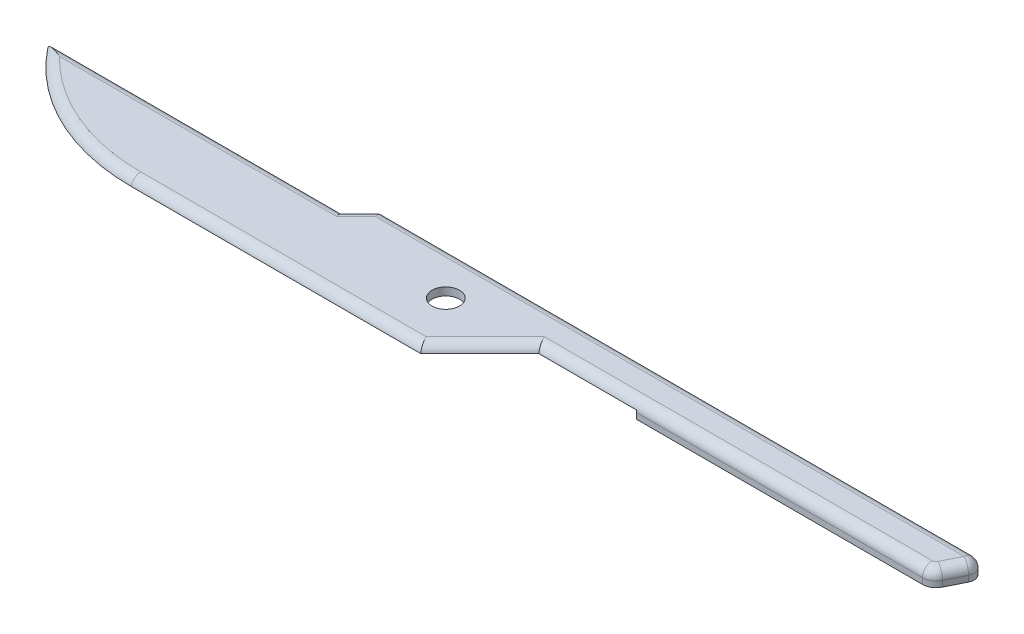
ISO-10303-21;
HEADER;
FILE_DESCRIPTION(('STEP AP214'),'2;1');
FILE_NAME('part.step','',(''),(''),'','','');
FILE_SCHEMA(('AUTOMOTIVE_DESIGN { 1 0 10303 214 1 1 1 1 }'));
ENDSEC;
DATA;
#1=APPLICATION_CONTEXT('core data for automotive mechanical design processes');
#2=APPLICATION_PROTOCOL_DEFINITION('international standard','automotive_design',2000,#1);
#3=PRODUCT_CONTEXT('',#1,'mechanical');
#4=PRODUCT('Part','Part','',(#3));
#5=PRODUCT_RELATED_PRODUCT_CATEGORY('part','',(#4));
#6=PRODUCT_DEFINITION_FORMATION('','',#4);
#7=PRODUCT_DEFINITION_CONTEXT('part definition',#1,'design');
#8=PRODUCT_DEFINITION('design','',#6,#7);
#9=PRODUCT_DEFINITION_SHAPE('','',#8);
#10=(LENGTH_UNIT() NAMED_UNIT(*) SI_UNIT(.MILLI.,.METRE.));
#11=(NAMED_UNIT(*) PLANE_ANGLE_UNIT() SI_UNIT($,.RADIAN.));
#12=(NAMED_UNIT(*) SI_UNIT($,.STERADIAN.) SOLID_ANGLE_UNIT());
#13=UNCERTAINTY_MEASURE_WITH_UNIT(LENGTH_MEASURE(1.E-05),#10,'distance_accuracy_value','');
#14=(GEOMETRIC_REPRESENTATION_CONTEXT(3) GLOBAL_UNCERTAINTY_ASSIGNED_CONTEXT((#13)) GLOBAL_UNIT_ASSIGNED_CONTEXT((#10,
#11,#12)) REPRESENTATION_CONTEXT('',''));
#15=CARTESIAN_POINT('',(0.,0.,0.));
#16=DIRECTION('',(0.,0.,1.));
#17=DIRECTION('',(1.,0.,0.));
#18=AXIS2_PLACEMENT_3D('',#15,#16,#17);
#19=CARTESIAN_POINT('',(10.4726882890689,1.016,-8.255));
#20=DIRECTION('',(0.,-1.,0.));
#21=DIRECTION('',(0.,0.,-1.));
#22=AXIS2_PLACEMENT_3D('',#19,#20,#21);
#23=PLANE('',#22);
#24=CARTESIAN_POINT('',(27.4176218444468,1.016,1.66382960533307));
#25=DIRECTION('',(0.,-1.,0.));
#26=DIRECTION('',(0.,0.,-1.));
#27=AXIS2_PLACEMENT_3D('',#24,#25,#26);
#28=CIRCLE('',#27,0.889);
#29=CARTESIAN_POINT('',(27.4176218444468,1.016,0.774829605333074));
#30=VERTEX_POINT('',#29);
#31=EDGE_CURVE('E338',#30,#30,#28,.T.);
#32=ORIENTED_EDGE('',*,*,#31,.T.);
#33=EDGE_LOOP('',(#32));
#34=FACE_BOUND('',#33,.T.);
#35=CARTESIAN_POINT('',(57.8705677840013,1.016,0.381));
#36=DIRECTION('',(0.,-1.,0.));
#37=DIRECTION('',(0.,0.,-1.));
#38=AXIS2_PLACEMENT_3D('',#35,#36,#37);
#39=CIRCLE('',#38,0.254);
#40=CARTESIAN_POINT('',(58.0977522905153,1.016,0.494592253256996));
#41=VERTEX_POINT('',#40);
#42=CARTESIAN_POINT('',(57.8705677840013,1.016,0.635));
#43=VERTEX_POINT('',#42);
#44=EDGE_CURVE('E159',#41,#43,#39,.T.);
#45=ORIENTED_EDGE('',*,*,#44,.F.);
#46=DIRECTION('',(0.44721359549996,0.,-0.894427190999915));
#47=VECTOR('',#46,1.);
#48=CARTESIAN_POINT('',(52.0725763915287,1.016,12.5449440512301));
#49=LINE('',#48,#47);
#50=CARTESIAN_POINT('',(58.6625484171438,1.016,-0.634999999999999));
#51=VERTEX_POINT('',#50);
#52=EDGE_CURVE('E207',#41,#51,#49,.T.);
#53=ORIENTED_EDGE('',*,*,#52,.T.);
#54=DIRECTION('',(-1.,0.,0.));
#55=VECTOR('',#54,1.);
#56=CARTESIAN_POINT('',(10.4726882890689,1.016,-0.635));
#57=LINE('',#56,#55);
#58=CARTESIAN_POINT('',(20.564881810245,1.016,-0.635));
#59=VERTEX_POINT('',#58);
#60=EDGE_CURVE('E209',#51,#59,#57,.T.);
#61=ORIENTED_EDGE('',*,*,#60,.T.);
#62=DIRECTION('',(0.707106781186547,0.,-0.707106781186548));
#63=VECTOR('',#62,1.);
#64=CARTESIAN_POINT('',(19.3287850496569,1.016,0.601096760588055));
#65=LINE('',#64,#63);
#66=CARTESIAN_POINT('',(19.3077114155781,1.016,0.622170394666928));
#67=VERTEX_POINT('',#66);
#68=EDGE_CURVE('E211',#59,#67,#65,.F.);
#69=ORIENTED_EDGE('',*,*,#68,.T.);
#70=DIRECTION('',(1.,0.,0.));
#71=VECTOR('',#70,1.);
#72=CARTESIAN_POINT('',(10.4726882890689,1.016,0.622170394666928));
#73=LINE('',#72,#71);
#74=CARTESIAN_POINT('',(1.37258486337736,1.016,0.622170394666928));
#75=VERTEX_POINT('',#74);
#76=EDGE_CURVE('E213',#67,#75,#73,.F.);
#77=ORIENTED_EDGE('',*,*,#76,.T.);
#78=CARTESIAN_POINT('',(10.4726882890689,1.016,-8.255));
#79=DIRECTION('',(0.,-1.,0.));
#80=DIRECTION('',(0.,0.,-1.));
#81=AXIS2_PLACEMENT_3D('',#78,#79,#80);
#82=CIRCLE('',#81,12.7128296053331);
#83=CARTESIAN_POINT('',(10.4726882890689,1.016,4.45782960533308));
#84=VERTEX_POINT('',#83);
#85=EDGE_CURVE('E198',#75,#84,#82,.F.);
#86=ORIENTED_EDGE('',*,*,#85,.T.);
#87=DIRECTION('',(-1.,0.,0.));
#88=VECTOR('',#87,1.);
#89=CARTESIAN_POINT('',(10.4726882890689,1.016,4.45782960533307));
#90=LINE('',#89,#88);
#91=CARTESIAN_POINT('',(28.9522885844219,1.016,4.45782960533307));
#92=VERTEX_POINT('',#91);
#93=EDGE_CURVE('E200',#84,#92,#90,.F.);
#94=ORIENTED_EDGE('',*,*,#93,.T.);
#95=DIRECTION('',(-0.707106781186547,0.,0.707106781186548));
#96=VECTOR('',#95,1.);
#97=CARTESIAN_POINT('',(26.068903239412,1.016,7.34121495034306));
#98=LINE('',#97,#96);
#99=CARTESIAN_POINT('',(32.775118189755,1.016,0.635000000000002));
#100=VERTEX_POINT('',#99);
#101=EDGE_CURVE('E202',#92,#100,#98,.F.);
#102=ORIENTED_EDGE('',*,*,#101,.T.);
#103=DIRECTION('',(1.,0.,0.));
#104=VECTOR('',#103,1.);
#105=CARTESIAN_POINT('',(10.4726882890689,1.016,0.635000000000005));
#106=LINE('',#105,#104);
#107=EDGE_CURVE('E204',#100,#43,#106,.T.);
#108=ORIENTED_EDGE('',*,*,#107,.T.);
#109=EDGE_LOOP('',(#45,#53,#61,#69,#77,#86,#94,#102,#108));
#110=FACE_BOUND('',#109,.T.);
#111=ADVANCED_FACE('F40',(#34,#110),#23,.F.);
#112=CARTESIAN_POINT('',(58.42,1.016,1.27));
#113=DIRECTION('',(0.,0.,-1.));
#114=DIRECTION('',(-1.,0.,0.));
#115=AXIS2_PLACEMENT_3D('',#112,#113,#114);
#116=PLANE('',#115);
#117=DIRECTION('',(1.,0.,0.));
#118=VECTOR('',#117,1.);
#119=CARTESIAN_POINT('',(58.42,0.,1.27));
#120=LINE('',#119,#118);
#121=CARTESIAN_POINT('',(39.37,0.,1.27));
#122=VERTEX_POINT('',#121);
#123=CARTESIAN_POINT('',(57.8705677840013,0.,1.27));
#124=VERTEX_POINT('',#123);
#125=EDGE_CURVE('E190',#122,#124,#120,.T.);
#126=ORIENTED_EDGE('',*,*,#125,.T.);
#127=DIRECTION('',(0.,-1.,0.));
#128=VECTOR('',#127,1.);
#129=CARTESIAN_POINT('',(57.8705677840013,1.016,1.27));
#130=LINE('',#129,#128);
#131=CARTESIAN_POINT('',(57.8705677840013,0.381,1.27));
#132=VERTEX_POINT('',#131);
#133=EDGE_CURVE('E49',#124,#132,#130,.F.);
#134=ORIENTED_EDGE('',*,*,#133,.T.);
#135=DIRECTION('',(1.,0.,0.));
#136=VECTOR('',#135,1.);
#137=CARTESIAN_POINT('',(58.42,0.381,1.27));
#138=LINE('',#137,#136);
#139=CARTESIAN_POINT('',(39.37,0.381,1.27));
#140=VERTEX_POINT('',#139);
#141=EDGE_CURVE('E231',#132,#140,#138,.F.);
#142=ORIENTED_EDGE('',*,*,#141,.T.);
#143=DIRECTION('',(0.,-1.,0.));
#144=VECTOR('',#143,1.);
#145=CARTESIAN_POINT('',(39.37,0.508,1.27));
#146=LINE('',#145,#144);
#147=EDGE_CURVE('E188',#140,#122,#146,.T.);
#148=ORIENTED_EDGE('',*,*,#147,.T.);
#149=EDGE_LOOP('',(#126,#134,#142,#148));
#150=FACE_BOUND('',#149,.T.);
#151=ADVANCED_FACE('F252',(#150),#116,.F.);
#152=CARTESIAN_POINT('',(59.69,1.016,-1.27));
#153=DIRECTION('',(-0.894427190999915,0.,-0.44721359549996));
#154=DIRECTION('',(-0.44721359549996,0.,0.894427190999915));
#155=AXIS2_PLACEMENT_3D('',#152,#153,#154);
#156=PLANE('',#155);
#157=DIRECTION('',(0.44721359549996,0.,-0.894427190999915));
#158=VECTOR('',#157,1.);
#159=CARTESIAN_POINT('',(59.69,0.381,-1.27));
#160=LINE('',#159,#158);
#161=CARTESIAN_POINT('',(59.2305096834288,0.381,-0.351019366857527));
#162=VERTEX_POINT('',#161);
#163=CARTESIAN_POINT('',(58.6657135568003,0.381,0.778572886399467));
#164=VERTEX_POINT('',#163);
#165=EDGE_CURVE('E229',#162,#164,#160,.F.);
#166=ORIENTED_EDGE('',*,*,#165,.T.);
#167=DIRECTION('',(0.,-1.,0.));
#168=VECTOR('',#167,1.);
#169=CARTESIAN_POINT('',(58.6657135568003,1.016,0.778572886399466));
#170=LINE('',#169,#168);
#171=CARTESIAN_POINT('',(58.6657135568003,0.,0.778572886399467));
#172=VERTEX_POINT('',#171);
#173=EDGE_CURVE('E64',#164,#172,#170,.T.);
#174=ORIENTED_EDGE('',*,*,#173,.T.);
#175=DIRECTION('',(0.44721359549996,0.,-0.894427190999915));
#176=VECTOR('',#175,1.);
#177=CARTESIAN_POINT('',(59.69,0.,-1.27));
#178=LINE('',#177,#176);
#179=CARTESIAN_POINT('',(59.2305096834288,0.,-0.351019366857526));
#180=VERTEX_POINT('',#179);
#181=EDGE_CURVE('E194',#172,#180,#178,.T.);
#182=ORIENTED_EDGE('',*,*,#181,.T.);
#183=DIRECTION('',(0.,-1.,0.));
#184=VECTOR('',#183,1.);
#185=CARTESIAN_POINT('',(59.2305096834288,1.016,-0.351019366857527));
#186=LINE('',#185,#184);
#187=EDGE_CURVE('E227',#180,#162,#186,.F.);
#188=ORIENTED_EDGE('',*,*,#187,.T.);
#189=EDGE_LOOP('',(#166,#174,#182,#188));
#190=FACE_BOUND('',#189,.T.);
#191=ADVANCED_FACE('F309',(#190),#156,.F.);
#192=CARTESIAN_POINT('',(20.32,1.016,-1.27));
#193=DIRECTION('',(0.,0.,1.));
#194=DIRECTION('',(1.,0.,0.));
#195=AXIS2_PLACEMENT_3D('',#192,#193,#194);
#196=PLANE('',#195);
#197=DIRECTION('',(0.,-1.,0.));
#198=VECTOR('',#197,1.);
#199=CARTESIAN_POINT('',(39.37,0.508,-1.27));
#200=LINE('',#199,#198);
#201=CARTESIAN_POINT('',(39.37,0.381,-1.27));
#202=VERTEX_POINT('',#201);
#203=CARTESIAN_POINT('',(39.37,0.,-1.27));
#204=VERTEX_POINT('',#203);
#205=EDGE_CURVE('E186',#202,#204,#200,.T.);
#206=ORIENTED_EDGE('',*,*,#205,.F.);
#207=DIRECTION('',(-1.,0.,0.));
#208=VECTOR('',#207,1.);
#209=CARTESIAN_POINT('',(20.32,0.381,-1.27));
#210=LINE('',#209,#208);
#211=CARTESIAN_POINT('',(58.6625484171438,0.381,-1.27));
#212=VERTEX_POINT('',#211);
#213=EDGE_CURVE('E225',#202,#212,#210,.F.);
#214=ORIENTED_EDGE('',*,*,#213,.T.);
#215=DIRECTION('',(0.,-1.,0.));
#216=VECTOR('',#215,1.);
#217=CARTESIAN_POINT('',(58.6625484171438,1.016,-1.27));
#218=LINE('',#217,#216);
#219=CARTESIAN_POINT('',(58.6625484171438,0.,-1.27));
#220=VERTEX_POINT('',#219);
#221=EDGE_CURVE('E223',#212,#220,#218,.T.);
#222=ORIENTED_EDGE('',*,*,#221,.T.);
#223=DIRECTION('',(-1.,0.,0.));
#224=VECTOR('',#223,1.);
#225=CARTESIAN_POINT('',(20.32,0.,-1.27));
#226=LINE('',#225,#224);
#227=EDGE_CURVE('E196',#220,#204,#226,.T.);
#228=ORIENTED_EDGE('',*,*,#227,.T.);
#229=EDGE_LOOP('',(#206,#214,#222,#228));
#230=FACE_BOUND('',#229,.T.);
#231=ADVANCED_FACE('F320',(#230),#196,.F.);
#232=CARTESIAN_POINT('',(10.4726882890689,0.,-8.255));
#233=DIRECTION('',(0.,-1.,0.));
#234=DIRECTION('',(0.,0.,-1.));
#235=AXIS2_PLACEMENT_3D('',#232,#233,#234);
#236=PLANE('',#235);
#237=ORIENTED_EDGE('',*,*,#181,.F.);
#238=CARTESIAN_POINT('',(57.8705677840013,0.,0.381));
#239=DIRECTION('',(0.,-1.,0.));
#240=DIRECTION('',(0.,0.,-1.));
#241=AXIS2_PLACEMENT_3D('',#238,#239,#240);
#242=CIRCLE('',#241,0.889);
#243=EDGE_CURVE('E56',#172,#124,#242,.T.);
#244=ORIENTED_EDGE('',*,*,#243,.T.);
#245=ORIENTED_EDGE('',*,*,#125,.F.);
#246=DIRECTION('',(0.,0.,1.));
#247=VECTOR('',#246,1.);
#248=CARTESIAN_POINT('',(39.37,0.,1.27));
#249=LINE('',#248,#247);
#250=EDGE_CURVE('E168',#204,#122,#249,.T.);
#251=ORIENTED_EDGE('',*,*,#250,.F.);
#252=ORIENTED_EDGE('',*,*,#227,.F.);
#253=CARTESIAN_POINT('',(58.6625484171438,0.,-0.635));
#254=DIRECTION('',(0.,-1.,0.));
#255=DIRECTION('',(0.,0.,-1.));
#256=AXIS2_PLACEMENT_3D('',#253,#254,#255);
#257=CIRCLE('',#256,0.635);
#258=EDGE_CURVE('E160',#220,#180,#257,.T.);
#259=ORIENTED_EDGE('',*,*,#258,.T.);
#260=EDGE_LOOP('',(#237,#244,#245,#251,#252,#259));
#261=FACE_BOUND('',#260,.T.);
#262=ADVANCED_FACE('F317',(#261),#236,.T.);
#263=CARTESIAN_POINT('',(39.37,0.508,1.27));
#264=DIRECTION('',(1.,0.,0.));
#265=DIRECTION('',(0.,0.,-1.));
#266=AXIS2_PLACEMENT_3D('',#263,#264,#265);
#267=PLANE('',#266);
#268=DIRECTION('',(0.,0.,1.));
#269=VECTOR('',#268,1.);
#270=CARTESIAN_POINT('',(39.37,0.508,1.27));
#271=LINE('',#270,#269);
#272=CARTESIAN_POINT('',(39.37,0.508,-1.25717039466693));
#273=VERTEX_POINT('',#272);
#274=CARTESIAN_POINT('',(39.37,0.508,1.25717039466693));
#275=VERTEX_POINT('',#274);
#276=EDGE_CURVE('E185',#273,#275,#271,.T.);
#277=ORIENTED_EDGE('',*,*,#276,.F.);
#278=CARTESIAN_POINT('',(39.37,0.381,-0.635));
#279=DIRECTION('',(1.,0.,0.));
#280=DIRECTION('',(0.,0.,-1.));
#281=AXIS2_PLACEMENT_3D('',#278,#279,#280);
#282=CIRCLE('',#281,0.635);
#283=EDGE_CURVE('E221',#273,#202,#282,.F.);
#284=ORIENTED_EDGE('',*,*,#283,.T.);
#285=ORIENTED_EDGE('',*,*,#205,.T.);
#286=ORIENTED_EDGE('',*,*,#250,.T.);
#287=ORIENTED_EDGE('',*,*,#147,.F.);
#288=CARTESIAN_POINT('',(39.37,0.381,0.635000000000002));
#289=DIRECTION('',(1.,0.,0.));
#290=DIRECTION('',(0.,0.,-1.));
#291=AXIS2_PLACEMENT_3D('',#288,#289,#290);
#292=CIRCLE('',#291,0.635);
#293=EDGE_CURVE('E219',#140,#275,#292,.F.);
#294=ORIENTED_EDGE('',*,*,#293,.T.);
#295=EDGE_LOOP('',(#277,#284,#285,#286,#287,#294));
#296=FACE_BOUND('',#295,.T.);
#297=ADVANCED_FACE('F315',(#296),#267,.F.);
#298=CARTESIAN_POINT('',(10.4726882890689,0.508,-8.255));
#299=DIRECTION('',(0.,-1.,0.));
#300=DIRECTION('',(0.,0.,-1.));
#301=AXIS2_PLACEMENT_3D('',#298,#299,#300);
#302=PLANE('',#301);
#303=CARTESIAN_POINT('',(27.4176218444468,0.508,1.66382960533307));
#304=DIRECTION('',(0.,-1.,0.));
#305=DIRECTION('',(0.,0.,-1.));
#306=AXIS2_PLACEMENT_3D('',#303,#304,#305);
#307=CIRCLE('',#306,0.889);
#308=CARTESIAN_POINT('',(27.4176218444468,0.508,0.774829605333074));
#309=VERTEX_POINT('',#308);
#310=EDGE_CURVE('E176',#309,#309,#307,.T.);
#311=ORIENTED_EDGE('',*,*,#310,.F.);
#312=EDGE_LOOP('',(#311));
#313=FACE_BOUND('',#312,.T.);
#314=DIRECTION('',(0.707106781186547,0.,-0.707106781186548));
#315=VECTOR('',#314,1.);
#316=CARTESIAN_POINT('',(19.05,0.508,0.));
#317=LINE('',#316,#315);
#318=CARTESIAN_POINT('',(19.05,0.508,0.));
#319=VERTEX_POINT('',#318);
#320=CARTESIAN_POINT('',(20.3071703946669,0.508,-1.25717039466693));
#321=VERTEX_POINT('',#320);
#322=EDGE_CURVE('E183',#319,#321,#317,.T.);
#323=ORIENTED_EDGE('',*,*,#322,.T.);
#324=DIRECTION('',(-1.,0.,0.));
#325=VECTOR('',#324,1.);
#326=CARTESIAN_POINT('',(20.3071703946669,0.508,-1.25717039466693));
#327=LINE('',#326,#325);
#328=EDGE_CURVE('E217',#321,#273,#327,.F.);
#329=ORIENTED_EDGE('',*,*,#328,.T.);
#330=ORIENTED_EDGE('',*,*,#276,.T.);
#331=DIRECTION('',(1.,0.,0.));
#332=VECTOR('',#331,1.);
#333=CARTESIAN_POINT('',(39.37,0.508,1.25717039466693));
#334=LINE('',#333,#332);
#335=CARTESIAN_POINT('',(33.0328296053331,0.508,1.25717039466693));
#336=VERTEX_POINT('',#335);
#337=EDGE_CURVE('E155',#275,#336,#334,.F.);
#338=ORIENTED_EDGE('',*,*,#337,.T.);
#339=CARTESIAN_POINT('',(33.0328296053331,0.508,1.25717039466693));
#340=CARTESIAN_POINT('',(33.02,0.508,1.27));
#341=B_SPLINE_CURVE_WITH_KNOTS('',1,(#339,#340),.UNSPECIFIED.,.F.,.F.,(2,2),(0.,1.),.UNSPECIFIED.);
#342=CARTESIAN_POINT('',(33.02,0.508,1.27));
#343=VERTEX_POINT('',#342);
#344=EDGE_CURVE('E148',#336,#343,#341,.T.);
#345=ORIENTED_EDGE('',*,*,#344,.T.);
#346=DIRECTION('',(-0.707106781186547,0.,0.707106781186548));
#347=VECTOR('',#346,1.);
#348=CARTESIAN_POINT('',(33.02,0.508,1.27));
#349=LINE('',#348,#347);
#350=CARTESIAN_POINT('',(29.21,0.508,5.08));
#351=VERTEX_POINT('',#350);
#352=EDGE_CURVE('E151',#343,#351,#349,.T.);
#353=ORIENTED_EDGE('',*,*,#352,.T.);
#354=DIRECTION('',(-1.,0.,0.));
#355=VECTOR('',#354,1.);
#356=CARTESIAN_POINT('',(29.21,0.508,5.08));
#357=LINE('',#356,#355);
#358=CARTESIAN_POINT('',(10.4726882890689,0.508,5.08));
#359=VERTEX_POINT('',#358);
#360=EDGE_CURVE('E167',#351,#359,#357,.T.);
#361=ORIENTED_EDGE('',*,*,#360,.T.);
#362=CARTESIAN_POINT('',(10.4726882890689,0.508,-8.255));
#363=DIRECTION('',(0.,-1.,0.));
#364=DIRECTION('',(0.,0.,-1.));
#365=AXIS2_PLACEMENT_3D('',#362,#363,#364);
#366=CIRCLE('',#365,13.335);
#367=CARTESIAN_POINT('',(0.,0.508,0.));
#368=VERTEX_POINT('',#367);
#369=EDGE_CURVE('E170',#359,#368,#366,.T.);
#370=ORIENTED_EDGE('',*,*,#369,.T.);
#371=DIRECTION('',(1.,0.,0.));
#372=VECTOR('',#371,1.);
#373=CARTESIAN_POINT('',(0.,0.508,0.));
#374=LINE('',#373,#372);
#375=EDGE_CURVE('E180',#368,#319,#374,.T.);
#376=ORIENTED_EDGE('',*,*,#375,.T.);
#377=EDGE_LOOP('',(#323,#329,#330,#338,#345,#353,#361,#370,#376));
#378=FACE_BOUND('',#377,.T.);
#379=ADVANCED_FACE('F150',(#313,#378),#302,.T.);
#380=CARTESIAN_POINT('',(58.6625484171438,1.016,-0.635));
#381=DIRECTION('',(0.,-1.,0.));
#382=DIRECTION('',(0.,0.,-1.));
#383=AXIS2_PLACEMENT_3D('',#380,#381,#382);
#384=CYLINDRICAL_SURFACE('',#383,0.635);
#385=ORIENTED_EDGE('',*,*,#258,.F.);
#386=ORIENTED_EDGE('',*,*,#221,.F.);
#387=CARTESIAN_POINT('',(58.6625484171438,0.381,-0.635000000000002));
#388=DIRECTION('',(0.,1.,0.));
#389=DIRECTION('',(0.,0.,1.));
#390=AXIS2_PLACEMENT_3D('',#387,#388,#389);
#391=CIRCLE('',#390,0.635);
#392=EDGE_CURVE('E173',#162,#212,#391,.T.);
#393=ORIENTED_EDGE('',*,*,#392,.F.);
#394=ORIENTED_EDGE('',*,*,#187,.F.);
#395=EDGE_LOOP('',(#385,#386,#393,#394));
#396=FACE_BOUND('',#395,.T.);
#397=ADVANCED_FACE('F288',(#396),#384,.T.);
#398=CARTESIAN_POINT('',(52.0725763915287,0.381,12.5449440512301));
#399=DIRECTION('',(0.44721359549996,0.,-0.894427190999915));
#400=DIRECTION('',(-0.894427190999915,0.,-0.44721359549996));
#401=AXIS2_PLACEMENT_3D('',#398,#399,#400);
#402=CYLINDRICAL_SURFACE('',#401,0.635);
#403=ORIENTED_EDGE('',*,*,#52,.F.);
#404=CARTESIAN_POINT('',(58.0977522905153,0.381,0.494592253256992));
#405=DIRECTION('',(0.447213595499962,0.,-0.894427190999914));
#406=DIRECTION('',(-0.894427190999914,0.,-0.447213595499962));
#407=AXIS2_PLACEMENT_3D('',#404,#405,#406);
#408=CIRCLE('',#407,0.635);
#409=EDGE_CURVE('E11',#41,#164,#408,.T.);
#410=ORIENTED_EDGE('',*,*,#409,.T.);
#411=ORIENTED_EDGE('',*,*,#165,.F.);
#412=CARTESIAN_POINT('',(58.6625484171438,0.381,-0.634999999999999));
#413=DIRECTION('',(0.447213595499959,0.,-0.894427190999915));
#414=DIRECTION('',(-0.894427190999916,0.,-0.447213595499959));
#415=AXIS2_PLACEMENT_3D('',#412,#413,#414);
#416=CIRCLE('',#415,0.635);
#417=EDGE_CURVE('E370',#51,#162,#416,.T.);
#418=ORIENTED_EDGE('',*,*,#417,.F.);
#419=EDGE_LOOP('',(#403,#410,#411,#418));
#420=FACE_BOUND('',#419,.T.);
#421=ADVANCED_FACE('F284',(#420),#402,.T.);
#422=CARTESIAN_POINT('',(10.4726882890689,0.381,0.635000000000005));
#423=DIRECTION('',(1.,0.,0.));
#424=DIRECTION('',(0.,0.,-1.));
#425=AXIS2_PLACEMENT_3D('',#422,#423,#424);
#426=CYLINDRICAL_SURFACE('',#425,0.635);
#427=ORIENTED_EDGE('',*,*,#141,.F.);
#428=CARTESIAN_POINT('',(57.8705677840013,0.381,0.635));
#429=DIRECTION('',(-1.,0.,0.));
#430=DIRECTION('',(0.,0.,1.));
#431=AXIS2_PLACEMENT_3D('',#428,#429,#430);
#432=CIRCLE('',#431,0.635);
#433=EDGE_CURVE('E334',#132,#43,#432,.T.);
#434=ORIENTED_EDGE('',*,*,#433,.T.);
#435=ORIENTED_EDGE('',*,*,#107,.F.);
#436=CARTESIAN_POINT('',(32.775118189755,0.381,0.635000000000003));
#437=DIRECTION('',(0.923879532511287,0.,-0.38268343236509));
#438=DIRECTION('',(0.38268343236509,0.,0.923879532511286));
#439=AXIS2_PLACEMENT_3D('',#436,#437,#438);
#440=ELLIPSE('',#439,0.68731904718567,0.635);
#441=EDGE_CURVE('E372',#336,#100,#440,.F.);
#442=ORIENTED_EDGE('',*,*,#441,.F.);
#443=ORIENTED_EDGE('',*,*,#337,.F.);
#444=ORIENTED_EDGE('',*,*,#293,.F.);
#445=EDGE_LOOP('',(#427,#434,#435,#442,#443,#444));
#446=FACE_BOUND('',#445,.T.);
#447=ADVANCED_FACE('F280',(#446),#426,.T.);
#448=CARTESIAN_POINT('',(58.6625484171438,0.381,-0.635));
#449=DIRECTION('',(0.,1.,0.));
#450=DIRECTION('',(0.,0.,1.));
#451=AXIS2_PLACEMENT_3D('',#448,#449,#450);
#452=SPHERICAL_SURFACE('',#451,0.635);
#453=ORIENTED_EDGE('',*,*,#417,.T.);
#454=ORIENTED_EDGE('',*,*,#392,.T.);
#455=CARTESIAN_POINT('',(58.6625484171438,0.381,-0.635));
#456=DIRECTION('',(1.,0.,0.));
#457=DIRECTION('',(0.,1.,0.));
#458=AXIS2_PLACEMENT_3D('',#455,#456,#457);
#459=CIRCLE('',#458,0.635);
#460=EDGE_CURVE('E364',#51,#212,#459,.F.);
#461=ORIENTED_EDGE('',*,*,#460,.F.);
#462=EDGE_LOOP('',(#453,#454,#461));
#463=FACE_BOUND('',#462,.T.);
#464=ADVANCED_FACE('F277',(#463),#452,.T.);
#465=CARTESIAN_POINT('',(32.5800590948775,0.381,0.830059094877509));
#466=DIRECTION('',(-0.707106781186547,0.,0.707106781186548));
#467=DIRECTION('',(0.707106781186548,0.,0.707106781186547));
#468=AXIS2_PLACEMENT_3D('',#465,#466,#467);
#469=CYLINDRICAL_SURFACE('',#468,0.635);
#470=ORIENTED_EDGE('',*,*,#441,.T.);
#471=ORIENTED_EDGE('',*,*,#101,.F.);
#472=CARTESIAN_POINT('',(28.9522885844219,0.381,4.45782960533307));
#473=DIRECTION('',(-0.923879532511287,0.,0.38268343236509));
#474=DIRECTION('',(-0.38268343236509,0.,-0.923879532511286));
#475=AXIS2_PLACEMENT_3D('',#472,#473,#474);
#476=ELLIPSE('',#475,0.68731904718567,0.635);
#477=EDGE_CURVE('E165',#351,#92,#476,.T.);
#478=ORIENTED_EDGE('',*,*,#477,.F.);
#479=ORIENTED_EDGE('',*,*,#352,.F.);
#480=ORIENTED_EDGE('',*,*,#344,.F.);
#481=EDGE_LOOP('',(#470,#471,#478,#479,#480));
#482=FACE_BOUND('',#481,.T.);
#483=ADVANCED_FACE('F162',(#482),#469,.T.);
#484=CARTESIAN_POINT('',(10.4726882890689,0.381,-0.635));
#485=DIRECTION('',(-1.,0.,0.));
#486=DIRECTION('',(0.,0.,1.));
#487=AXIS2_PLACEMENT_3D('',#484,#485,#486);
#488=CYLINDRICAL_SURFACE('',#487,0.635);
#489=ORIENTED_EDGE('',*,*,#283,.F.);
#490=ORIENTED_EDGE('',*,*,#328,.F.);
#491=CARTESIAN_POINT('',(20.564881810245,0.381,-0.634999999999999));
#492=DIRECTION('',(-0.923879532511287,0.,0.38268343236509));
#493=DIRECTION('',(-0.38268343236509,0.,-0.923879532511287));
#494=AXIS2_PLACEMENT_3D('',#491,#492,#493);
#495=ELLIPSE('',#494,0.68731904718567,0.635);
#496=EDGE_CURVE('E384',#59,#321,#495,.T.);
#497=ORIENTED_EDGE('',*,*,#496,.F.);
#498=ORIENTED_EDGE('',*,*,#60,.F.);
#499=ORIENTED_EDGE('',*,*,#460,.T.);
#500=ORIENTED_EDGE('',*,*,#213,.F.);
#501=EDGE_LOOP('',(#489,#490,#497,#498,#499,#500));
#502=FACE_BOUND('',#501,.T.);
#503=ADVANCED_FACE('F270',(#502),#488,.T.);
#504=CARTESIAN_POINT('',(29.21,0.381,4.45782960533307));
#505=DIRECTION('',(-1.,0.,0.));
#506=DIRECTION('',(0.,0.,1.));
#507=AXIS2_PLACEMENT_3D('',#504,#505,#506);
#508=CYLINDRICAL_SURFACE('',#507,0.635);
#509=ORIENTED_EDGE('',*,*,#477,.T.);
#510=ORIENTED_EDGE('',*,*,#93,.F.);
#511=CARTESIAN_POINT('',(10.4726882890689,0.381,4.45782960533308));
#512=DIRECTION('',(-1.,0.,0.));
#513=DIRECTION('',(0.,0.,1.));
#514=AXIS2_PLACEMENT_3D('',#511,#512,#513);
#515=CIRCLE('',#514,0.635);
#516=EDGE_CURVE('E386',#359,#84,#515,.T.);
#517=ORIENTED_EDGE('',*,*,#516,.F.);
#518=ORIENTED_EDGE('',*,*,#360,.F.);
#519=EDGE_LOOP('',(#509,#510,#517,#518));
#520=FACE_BOUND('',#519,.T.);
#521=ADVANCED_FACE('F266',(#520),#508,.T.);
#522=CARTESIAN_POINT('',(19.4899409051225,0.381,0.439940905122494));
#523=DIRECTION('',(0.707106781186547,0.,-0.707106781186548));
#524=DIRECTION('',(-0.707106781186548,0.,-0.707106781186547));
#525=AXIS2_PLACEMENT_3D('',#522,#523,#524);
#526=CYLINDRICAL_SURFACE('',#525,0.635);
#527=ORIENTED_EDGE('',*,*,#496,.T.);
#528=ORIENTED_EDGE('',*,*,#322,.F.);
#529=CARTESIAN_POINT('',(19.3077114155781,0.381,0.622170394666929));
#530=DIRECTION('',(0.923879532511287,0.,-0.38268343236509));
#531=DIRECTION('',(0.38268343236509,0.,0.923879532511287));
#532=AXIS2_PLACEMENT_3D('',#529,#530,#531);
#533=ELLIPSE('',#532,0.68731904718567,0.635);
#534=EDGE_CURVE('E339',#67,#319,#533,.F.);
#535=ORIENTED_EDGE('',*,*,#534,.F.);
#536=ORIENTED_EDGE('',*,*,#68,.F.);
#537=EDGE_LOOP('',(#527,#528,#535,#536));
#538=FACE_BOUND('',#537,.T.);
#539=ADVANCED_FACE('F262',(#538),#526,.T.);
#540=CARTESIAN_POINT('',(10.4726882890689,0.381,-8.255));
#541=DIRECTION('',(0.,1.,0.));
#542=DIRECTION('',(0.,0.,1.));
#543=AXIS2_PLACEMENT_3D('',#540,#541,#542);
#544=TOROIDAL_SURFACE('',#543,12.7128296053331,0.635);
#545=ORIENTED_EDGE('',*,*,#516,.T.);
#546=ORIENTED_EDGE('',*,*,#85,.F.);
#547=CARTESIAN_POINT('',(0.,0.508,0.));
#548=CARTESIAN_POINT('',(0.0104027494642232,0.532592816702282,0.00504687596182047));
#549=CARTESIAN_POINT('',(0.0231869355967042,0.555640805756114,0.011239999264738));
#550=CARTESIAN_POINT('',(0.0520278498347453,0.598564408445777,0.0251790271221921));
#551=CARTESIAN_POINT('',(0.0680313994786914,0.618483242148396,0.0328996692498052));
#552=CARTESIAN_POINT('',(0.112526801728775,0.667059006072855,0.0543076421016833));
#553=CARTESIAN_POINT('',(0.142729118409989,0.693740214736416,0.0687851256943454));
#554=CARTESIAN_POINT('',(0.206482300210347,0.742313313586974,0.099195200592723));
#555=CARTESIAN_POINT('',(0.24006344446507,0.764155003049711,0.115140816177853));
#556=CARTESIAN_POINT('',(0.310702098459403,0.804779289693623,0.148507206930529));
#557=CARTESIAN_POINT('',(0.347848370354233,0.823376143770859,0.165962095710405));
#558=CARTESIAN_POINT('',(0.423497160534241,0.857124514370073,0.201305983393887));
#559=CARTESIAN_POINT('',(0.462001055141755,0.872272411270132,0.219195416759962));
#560=CARTESIAN_POINT('',(0.539865517086099,0.899688130737034,0.25515855087681));
#561=CARTESIAN_POINT('',(0.579225066106547,0.911959191794441,0.273232020297975));
#562=CARTESIAN_POINT('',(0.658590824044171,0.93406769914105,0.309455007675073));
#563=CARTESIAN_POINT('',(0.698597201182757,0.943904501140045,0.327604544474352));
#564=CARTESIAN_POINT('',(0.790234537178048,0.963882554750693,0.368919153013878));
#565=CARTESIAN_POINT('',(0.842013718581285,0.973352327898874,0.392079910202414));
#566=CARTESIAN_POINT('',(0.94609693617503,0.989273103986747,0.438257773337546));
#567=CARTESIAN_POINT('',(0.998401113651301,0.995723270768687,0.461274837755397));
#568=CARTESIAN_POINT('',(1.15572499877586,1.01101646073578,0.529929729189384));
#569=CARTESIAN_POINT('',(1.26131331057533,1.01583405273385,0.575242209569583));
#570=CARTESIAN_POINT('',(1.36892554005037,1.01599858008669,0.620627772067094));
#571=CARTESIAN_POINT('',(1.37075517410681,1.01599998456217,0.621399188531257));
#572=CARTESIAN_POINT('',(1.37258486337737,1.016,0.622170394666927));
#573=B_SPLINE_CURVE_WITH_KNOTS('',3,(#547,#548,#549,#550,#551,#552,#553,#554,#555,#556,#557,
#558,#559,#560,#561,#562,#563,#564,#565,#566,#567,#568,#569,#570,#571,#572),.UNSPECIFIED.,.F.,
.F.,(4,2,2,2,2,2,2,2,2,2,2,2,4),(0.,0.0809590548189537,0.160676874867877,0.288475630007181,
0.417543712542883,0.552518538257094,0.687634371443562,0.82259736473642,0.957596041394341,
1.13001670790055,1.30248509113067,1.64689761843855,1.65285444449481),.UNSPECIFIED.);
#574=EDGE_CURVE('E237',#368,#75,#573,.T.);
#575=ORIENTED_EDGE('',*,*,#574,.F.);
#576=ORIENTED_EDGE('',*,*,#369,.F.);
#577=EDGE_LOOP('',(#545,#546,#575,#576));
#578=FACE_BOUND('',#577,.T.);
#579=ADVANCED_FACE('F257',(#578),#544,.T.);
#580=CARTESIAN_POINT('',(0.,0.381,0.622170394666927));
#581=DIRECTION('',(1.,0.,0.));
#582=DIRECTION('',(0.,0.,-1.));
#583=AXIS2_PLACEMENT_3D('',#580,#581,#582);
#584=CYLINDRICAL_SURFACE('',#583,0.635);
#585=ORIENTED_EDGE('',*,*,#534,.T.);
#586=ORIENTED_EDGE('',*,*,#375,.F.);
#587=ORIENTED_EDGE('',*,*,#574,.T.);
#588=ORIENTED_EDGE('',*,*,#76,.F.);
#589=EDGE_LOOP('',(#585,#586,#587,#588));
#590=FACE_BOUND('',#589,.T.);
#591=ADVANCED_FACE('F254',(#590),#584,.T.);
#592=CARTESIAN_POINT('',(57.8705677840013,1.016,0.381));
#593=DIRECTION('',(0.,-1.,0.));
#594=DIRECTION('',(0.,0.,-1.));
#595=AXIS2_PLACEMENT_3D('',#592,#593,#594);
#596=CYLINDRICAL_SURFACE('',#595,0.889);
#597=ORIENTED_EDGE('',*,*,#243,.F.);
#598=ORIENTED_EDGE('',*,*,#173,.F.);
#599=CARTESIAN_POINT('',(57.8705677840013,0.381,0.381));
#600=DIRECTION('',(0.,-1.,0.));
#601=DIRECTION('',(0.,0.,-1.));
#602=AXIS2_PLACEMENT_3D('',#599,#600,#601);
#603=CIRCLE('',#602,0.889);
#604=EDGE_CURVE('E44',#132,#164,#603,.F.);
#605=ORIENTED_EDGE('',*,*,#604,.F.);
#606=ORIENTED_EDGE('',*,*,#133,.F.);
#607=EDGE_LOOP('',(#597,#598,#605,#606));
#608=FACE_BOUND('',#607,.T.);
#609=ADVANCED_FACE('F42',(#608),#596,.T.);
#610=CARTESIAN_POINT('',(57.8705677840013,0.381,0.381));
#611=DIRECTION('',(0.,-1.,0.));
#612=DIRECTION('',(0.,0.,-1.));
#613=AXIS2_PLACEMENT_3D('',#610,#611,#612);
#614=DEGENERATE_TOROIDAL_SURFACE('',#613,0.254,0.635,.T.);
#615=ORIENTED_EDGE('',*,*,#409,.F.);
#616=ORIENTED_EDGE('',*,*,#44,.T.);
#617=ORIENTED_EDGE('',*,*,#433,.F.);
#618=ORIENTED_EDGE('',*,*,#604,.T.);
#619=EDGE_LOOP('',(#615,#616,#617,#618));
#620=FACE_BOUND('',#619,.T.);
#621=ADVANCED_FACE('F292',(#620),#614,.T.);
#622=CARTESIAN_POINT('',(27.4176218444468,1.016,1.66382960533307));
#623=DIRECTION('',(0.,-1.,0.));
#624=DIRECTION('',(0.,0.,-1.));
#625=AXIS2_PLACEMENT_3D('',#622,#623,#624);
#626=CYLINDRICAL_SURFACE('',#625,0.889);
#627=ORIENTED_EDGE('',*,*,#31,.F.);
#628=EDGE_LOOP('',(#627));
#629=FACE_BOUND('',#628,.T.);
#630=ORIENTED_EDGE('',*,*,#310,.T.);
#631=EDGE_LOOP('',(#630));
#632=FACE_BOUND('',#631,.T.);
#633=ADVANCED_FACE('F294',(#629,#632),#626,.F.);
#634=CLOSED_SHELL('',(#111,#151,#191,#231,#262,#297,#379,#397,#421,#447,#464,#483,#503,#521,
#539,#579,#591,#609,#621,#633));
#635=MANIFOLD_SOLID_BREP('B2',#634);
#636=ADVANCED_BREP_SHAPE_REPRESENTATION('',(#18,#635),#14);
#637=SHAPE_DEFINITION_REPRESENTATION(#9,#636);
ENDSEC;
END-ISO-10303-21;
